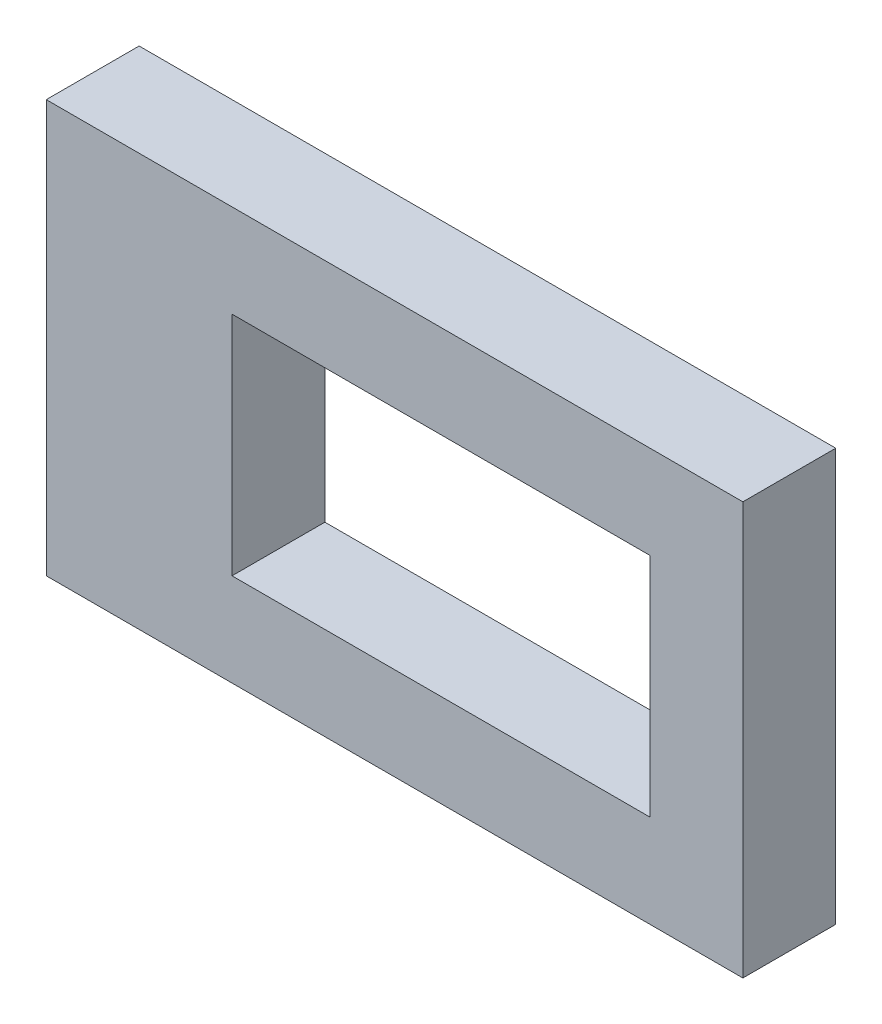
ISO-10303-21;
HEADER;
FILE_DESCRIPTION(('STEP AP214'),'2;1');
FILE_NAME('part.step','',(''),(''),'','','');
FILE_SCHEMA(('AUTOMOTIVE_DESIGN { 1 0 10303 214 1 1 1 1 }'));
ENDSEC;
DATA;
#1=APPLICATION_CONTEXT('core data for automotive mechanical design processes');
#2=APPLICATION_PROTOCOL_DEFINITION('international standard','automotive_design',2000,#1);
#3=PRODUCT_CONTEXT('',#1,'mechanical');
#4=PRODUCT('Part','Part','',(#3));
#5=PRODUCT_RELATED_PRODUCT_CATEGORY('part','',(#4));
#6=PRODUCT_DEFINITION_FORMATION('','',#4);
#7=PRODUCT_DEFINITION_CONTEXT('part definition',#1,'design');
#8=PRODUCT_DEFINITION('design','',#6,#7);
#9=PRODUCT_DEFINITION_SHAPE('','',#8);
#10=(LENGTH_UNIT() NAMED_UNIT(*) SI_UNIT(.MILLI.,.METRE.));
#11=(NAMED_UNIT(*) PLANE_ANGLE_UNIT() SI_UNIT($,.RADIAN.));
#12=(NAMED_UNIT(*) SI_UNIT($,.STERADIAN.) SOLID_ANGLE_UNIT());
#13=UNCERTAINTY_MEASURE_WITH_UNIT(LENGTH_MEASURE(1.E-05),#10,'distance_accuracy_value','');
#14=(GEOMETRIC_REPRESENTATION_CONTEXT(3) GLOBAL_UNCERTAINTY_ASSIGNED_CONTEXT((#13)) GLOBAL_UNIT_ASSIGNED_CONTEXT((#10,
#11,#12)) REPRESENTATION_CONTEXT('',''));
#15=CARTESIAN_POINT('',(0.,0.,0.));
#16=DIRECTION('',(0.,0.,1.));
#17=DIRECTION('',(1.,0.,0.));
#18=AXIS2_PLACEMENT_3D('',#15,#16,#17);
#19=CARTESIAN_POINT('',(0.,0.,5.));
#20=DIRECTION('',(0.,0.,1.));
#21=DIRECTION('',(1.,0.,0.));
#22=AXIS2_PLACEMENT_3D('',#19,#20,#21);
#23=PLANE('',#22);
#24=DIRECTION('',(0.,1.,0.));
#25=VECTOR('',#24,1.);
#26=CARTESIAN_POINT('',(5.,-5.,5.));
#27=LINE('',#26,#25);
#28=CARTESIAN_POINT('',(5.,-5.,5.));
#29=VERTEX_POINT('',#28);
#30=CARTESIAN_POINT('',(5.,17.2,5.));
#31=VERTEX_POINT('',#30);
#32=EDGE_CURVE('E153',#29,#31,#27,.T.);
#33=ORIENTED_EDGE('',*,*,#32,.T.);
#34=DIRECTION('',(-1.,0.,0.));
#35=VECTOR('',#34,1.);
#36=CARTESIAN_POINT('',(5.,17.2,5.));
#37=LINE('',#36,#35);
#38=CARTESIAN_POINT('',(-32.5,17.2,5.));
#39=VERTEX_POINT('',#38);
#40=EDGE_CURVE('E157',#31,#39,#37,.T.);
#41=ORIENTED_EDGE('',*,*,#40,.T.);
#42=DIRECTION('',(0.,-1.,0.));
#43=VECTOR('',#42,1.);
#44=CARTESIAN_POINT('',(-32.5,-5.,5.));
#45=LINE('',#44,#43);
#46=CARTESIAN_POINT('',(-32.5,-5.,5.));
#47=VERTEX_POINT('',#46);
#48=EDGE_CURVE('E161',#39,#47,#45,.T.);
#49=ORIENTED_EDGE('',*,*,#48,.T.);
#50=DIRECTION('',(1.,0.,0.));
#51=VECTOR('',#50,1.);
#52=CARTESIAN_POINT('',(5.,-5.,5.));
#53=LINE('',#52,#51);
#54=EDGE_CURVE('E164',#47,#29,#53,.T.);
#55=ORIENTED_EDGE('',*,*,#54,.T.);
#56=EDGE_LOOP('',(#33,#41,#49,#55));
#57=FACE_BOUND('',#56,.T.);
#58=DIRECTION('',(-1.,0.,0.));
#59=VECTOR('',#58,1.);
#60=CARTESIAN_POINT('',(0.,12.2,5.));
#61=LINE('',#60,#59);
#62=CARTESIAN_POINT('',(0.,12.2,5.));
#63=VERTEX_POINT('',#62);
#64=CARTESIAN_POINT('',(-22.5,12.2,5.));
#65=VERTEX_POINT('',#64);
#66=EDGE_CURVE('E114',#63,#65,#61,.T.);
#67=ORIENTED_EDGE('',*,*,#66,.F.);
#68=DIRECTION('',(0.,1.,0.));
#69=VECTOR('',#68,1.);
#70=CARTESIAN_POINT('',(0.,0.,5.));
#71=LINE('',#70,#69);
#72=CARTESIAN_POINT('',(0.,0.,5.));
#73=VERTEX_POINT('',#72);
#74=EDGE_CURVE('E105',#73,#63,#71,.T.);
#75=ORIENTED_EDGE('',*,*,#74,.F.);
#76=DIRECTION('',(1.,0.,0.));
#77=VECTOR('',#76,1.);
#78=CARTESIAN_POINT('',(0.,0.,5.));
#79=LINE('',#78,#77);
#80=CARTESIAN_POINT('',(-22.5,0.,5.));
#81=VERTEX_POINT('',#80);
#82=EDGE_CURVE('E131',#81,#73,#79,.T.);
#83=ORIENTED_EDGE('',*,*,#82,.F.);
#84=DIRECTION('',(0.,-1.,0.));
#85=VECTOR('',#84,1.);
#86=CARTESIAN_POINT('',(-22.5,0.,5.));
#87=LINE('',#86,#85);
#88=EDGE_CURVE('E127',#65,#81,#87,.T.);
#89=ORIENTED_EDGE('',*,*,#88,.F.);
#90=EDGE_LOOP('',(#67,#75,#83,#89));
#91=FACE_BOUND('',#90,.T.);
#92=ADVANCED_FACE('F39',(#57,#91),#23,.T.);
#93=CARTESIAN_POINT('',(0.,0.,0.));
#94=DIRECTION('',(0.,0.,1.));
#95=DIRECTION('',(1.,0.,0.));
#96=AXIS2_PLACEMENT_3D('',#93,#94,#95);
#97=PLANE('',#96);
#98=DIRECTION('',(0.,1.,0.));
#99=VECTOR('',#98,1.);
#100=CARTESIAN_POINT('',(5.,-5.,0.));
#101=LINE('',#100,#99);
#102=CARTESIAN_POINT('',(5.,-5.,0.));
#103=VERTEX_POINT('',#102);
#104=CARTESIAN_POINT('',(5.,17.2,0.));
#105=VERTEX_POINT('',#104);
#106=EDGE_CURVE('E123',#103,#105,#101,.T.);
#107=ORIENTED_EDGE('',*,*,#106,.F.);
#108=DIRECTION('',(1.,0.,0.));
#109=VECTOR('',#108,1.);
#110=CARTESIAN_POINT('',(5.,-5.,0.));
#111=LINE('',#110,#109);
#112=CARTESIAN_POINT('',(-32.5,-5.,0.));
#113=VERTEX_POINT('',#112);
#114=EDGE_CURVE('E158',#113,#103,#111,.T.);
#115=ORIENTED_EDGE('',*,*,#114,.F.);
#116=DIRECTION('',(0.,-1.,0.));
#117=VECTOR('',#116,1.);
#118=CARTESIAN_POINT('',(-32.5,-5.,0.));
#119=LINE('',#118,#117);
#120=CARTESIAN_POINT('',(-32.5,17.2,0.));
#121=VERTEX_POINT('',#120);
#122=EDGE_CURVE('E174',#121,#113,#119,.T.);
#123=ORIENTED_EDGE('',*,*,#122,.F.);
#124=DIRECTION('',(-1.,0.,0.));
#125=VECTOR('',#124,1.);
#126=CARTESIAN_POINT('',(5.,17.2,0.));
#127=LINE('',#126,#125);
#128=EDGE_CURVE('E171',#105,#121,#127,.T.);
#129=ORIENTED_EDGE('',*,*,#128,.F.);
#130=EDGE_LOOP('',(#107,#115,#123,#129));
#131=FACE_BOUND('',#130,.T.);
#132=DIRECTION('',(0.,1.,0.));
#133=VECTOR('',#132,1.);
#134=CARTESIAN_POINT('',(0.,0.,0.));
#135=LINE('',#134,#133);
#136=CARTESIAN_POINT('',(0.,0.,0.));
#137=VERTEX_POINT('',#136);
#138=CARTESIAN_POINT('',(0.,12.2,0.));
#139=VERTEX_POINT('',#138);
#140=EDGE_CURVE('E63',#137,#139,#135,.T.);
#141=ORIENTED_EDGE('',*,*,#140,.T.);
#142=DIRECTION('',(-1.,0.,0.));
#143=VECTOR('',#142,1.);
#144=CARTESIAN_POINT('',(0.,12.2,0.));
#145=LINE('',#144,#143);
#146=CARTESIAN_POINT('',(-22.5,12.2,0.));
#147=VERTEX_POINT('',#146);
#148=EDGE_CURVE('E121',#139,#147,#145,.T.);
#149=ORIENTED_EDGE('',*,*,#148,.T.);
#150=DIRECTION('',(0.,-1.,0.));
#151=VECTOR('',#150,1.);
#152=CARTESIAN_POINT('',(-22.5,0.,0.));
#153=LINE('',#152,#151);
#154=CARTESIAN_POINT('',(-22.5,0.,0.));
#155=VERTEX_POINT('',#154);
#156=EDGE_CURVE('E140',#147,#155,#153,.T.);
#157=ORIENTED_EDGE('',*,*,#156,.T.);
#158=DIRECTION('',(1.,0.,0.));
#159=VECTOR('',#158,1.);
#160=CARTESIAN_POINT('',(0.,0.,0.));
#161=LINE('',#160,#159);
#162=EDGE_CURVE('E115',#155,#137,#161,.T.);
#163=ORIENTED_EDGE('',*,*,#162,.T.);
#164=EDGE_LOOP('',(#141,#149,#157,#163));
#165=FACE_BOUND('',#164,.T.);
#166=ADVANCED_FACE('F197',(#131,#165),#97,.F.);
#167=CARTESIAN_POINT('',(5.,-5.,5.));
#168=DIRECTION('',(-1.,0.,0.));
#169=DIRECTION('',(0.,-1.,0.));
#170=AXIS2_PLACEMENT_3D('',#167,#168,#169);
#171=PLANE('',#170);
#172=ORIENTED_EDGE('',*,*,#106,.T.);
#173=DIRECTION('',(0.,0.,-1.));
#174=VECTOR('',#173,1.);
#175=CARTESIAN_POINT('',(5.,17.2,5.));
#176=LINE('',#175,#174);
#177=EDGE_CURVE('E11',#31,#105,#176,.T.);
#178=ORIENTED_EDGE('',*,*,#177,.F.);
#179=ORIENTED_EDGE('',*,*,#32,.F.);
#180=DIRECTION('',(0.,0.,-1.));
#181=VECTOR('',#180,1.);
#182=CARTESIAN_POINT('',(5.,-5.,5.));
#183=LINE('',#182,#181);
#184=EDGE_CURVE('E167',#29,#103,#183,.T.);
#185=ORIENTED_EDGE('',*,*,#184,.T.);
#186=EDGE_LOOP('',(#172,#178,#179,#185));
#187=FACE_BOUND('',#186,.T.);
#188=ADVANCED_FACE('F41',(#187),#171,.F.);
#189=CARTESIAN_POINT('',(5.,17.2,5.));
#190=DIRECTION('',(0.,-1.,0.));
#191=DIRECTION('',(1.,0.,0.));
#192=AXIS2_PLACEMENT_3D('',#189,#190,#191);
#193=PLANE('',#192);
#194=ORIENTED_EDGE('',*,*,#128,.T.);
#195=DIRECTION('',(0.,0.,-1.));
#196=VECTOR('',#195,1.);
#197=CARTESIAN_POINT('',(-32.5,17.2,5.));
#198=LINE('',#197,#196);
#199=EDGE_CURVE('E48',#39,#121,#198,.T.);
#200=ORIENTED_EDGE('',*,*,#199,.F.);
#201=ORIENTED_EDGE('',*,*,#40,.F.);
#202=ORIENTED_EDGE('',*,*,#177,.T.);
#203=EDGE_LOOP('',(#194,#200,#201,#202));
#204=FACE_BOUND('',#203,.T.);
#205=ADVANCED_FACE('F207',(#204),#193,.F.);
#206=CARTESIAN_POINT('',(-32.5,-5.,5.));
#207=DIRECTION('',(1.,0.,0.));
#208=DIRECTION('',(0.,0.,-1.));
#209=AXIS2_PLACEMENT_3D('',#206,#207,#208);
#210=PLANE('',#209);
#211=ORIENTED_EDGE('',*,*,#122,.T.);
#212=DIRECTION('',(0.,0.,-1.));
#213=VECTOR('',#212,1.);
#214=CARTESIAN_POINT('',(-32.5,-5.,5.));
#215=LINE('',#214,#213);
#216=EDGE_CURVE('E182',#47,#113,#215,.T.);
#217=ORIENTED_EDGE('',*,*,#216,.F.);
#218=ORIENTED_EDGE('',*,*,#48,.F.);
#219=ORIENTED_EDGE('',*,*,#199,.T.);
#220=EDGE_LOOP('',(#211,#217,#218,#219));
#221=FACE_BOUND('',#220,.T.);
#222=ADVANCED_FACE('F191',(#221),#210,.F.);
#223=CARTESIAN_POINT('',(5.,-5.,5.));
#224=DIRECTION('',(0.,1.,0.));
#225=DIRECTION('',(0.,0.,1.));
#226=AXIS2_PLACEMENT_3D('',#223,#224,#225);
#227=PLANE('',#226);
#228=ORIENTED_EDGE('',*,*,#114,.T.);
#229=ORIENTED_EDGE('',*,*,#184,.F.);
#230=ORIENTED_EDGE('',*,*,#54,.F.);
#231=ORIENTED_EDGE('',*,*,#216,.T.);
#232=EDGE_LOOP('',(#228,#229,#230,#231));
#233=FACE_BOUND('',#232,.T.);
#234=ADVANCED_FACE('F201',(#233),#227,.F.);
#235=CARTESIAN_POINT('',(0.,0.,5.));
#236=DIRECTION('',(-1.,0.,0.));
#237=DIRECTION('',(0.,-1.,0.));
#238=AXIS2_PLACEMENT_3D('',#235,#236,#237);
#239=PLANE('',#238);
#240=ORIENTED_EDGE('',*,*,#140,.F.);
#241=DIRECTION('',(0.,0.,-1.));
#242=VECTOR('',#241,1.);
#243=CARTESIAN_POINT('',(0.,0.,5.));
#244=LINE('',#243,#242);
#245=EDGE_CURVE('E109',#73,#137,#244,.T.);
#246=ORIENTED_EDGE('',*,*,#245,.F.);
#247=ORIENTED_EDGE('',*,*,#74,.T.);
#248=DIRECTION('',(0.,0.,-1.));
#249=VECTOR('',#248,1.);
#250=CARTESIAN_POINT('',(0.,12.2,5.));
#251=LINE('',#250,#249);
#252=EDGE_CURVE('E108',#63,#139,#251,.T.);
#253=ORIENTED_EDGE('',*,*,#252,.T.);
#254=EDGE_LOOP('',(#240,#246,#247,#253));
#255=FACE_BOUND('',#254,.T.);
#256=ADVANCED_FACE('F107',(#255),#239,.T.);
#257=CARTESIAN_POINT('',(0.,12.2,5.));
#258=DIRECTION('',(0.,-1.,0.));
#259=DIRECTION('',(0.,0.,-1.));
#260=AXIS2_PLACEMENT_3D('',#257,#258,#259);
#261=PLANE('',#260);
#262=ORIENTED_EDGE('',*,*,#148,.F.);
#263=ORIENTED_EDGE('',*,*,#252,.F.);
#264=ORIENTED_EDGE('',*,*,#66,.T.);
#265=DIRECTION('',(0.,0.,-1.));
#266=VECTOR('',#265,1.);
#267=CARTESIAN_POINT('',(-22.5,12.2,5.));
#268=LINE('',#267,#266);
#269=EDGE_CURVE('E124',#65,#147,#268,.T.);
#270=ORIENTED_EDGE('',*,*,#269,.T.);
#271=EDGE_LOOP('',(#262,#263,#264,#270));
#272=FACE_BOUND('',#271,.T.);
#273=ADVANCED_FACE('F118',(#272),#261,.T.);
#274=CARTESIAN_POINT('',(-22.5,0.,5.));
#275=DIRECTION('',(1.,0.,0.));
#276=DIRECTION('',(0.,0.,-1.));
#277=AXIS2_PLACEMENT_3D('',#274,#275,#276);
#278=PLANE('',#277);
#279=ORIENTED_EDGE('',*,*,#156,.F.);
#280=ORIENTED_EDGE('',*,*,#269,.F.);
#281=ORIENTED_EDGE('',*,*,#88,.T.);
#282=DIRECTION('',(0.,0.,-1.));
#283=VECTOR('',#282,1.);
#284=CARTESIAN_POINT('',(-22.5,0.,5.));
#285=LINE('',#284,#283);
#286=EDGE_CURVE('E55',#81,#155,#285,.T.);
#287=ORIENTED_EDGE('',*,*,#286,.T.);
#288=EDGE_LOOP('',(#279,#280,#281,#287));
#289=FACE_BOUND('',#288,.T.);
#290=ADVANCED_FACE('F230',(#289),#278,.T.);
#291=CARTESIAN_POINT('',(0.,0.,5.));
#292=DIRECTION('',(0.,1.,0.));
#293=DIRECTION('',(-1.,0.,0.));
#294=AXIS2_PLACEMENT_3D('',#291,#292,#293);
#295=PLANE('',#294);
#296=ORIENTED_EDGE('',*,*,#162,.F.);
#297=ORIENTED_EDGE('',*,*,#286,.F.);
#298=ORIENTED_EDGE('',*,*,#82,.T.);
#299=ORIENTED_EDGE('',*,*,#245,.T.);
#300=EDGE_LOOP('',(#296,#297,#298,#299));
#301=FACE_BOUND('',#300,.T.);
#302=ADVANCED_FACE('F234',(#301),#295,.T.);
#303=CLOSED_SHELL('',(#92,#166,#188,#205,#222,#234,#256,#273,#290,#302));
#304=MANIFOLD_SOLID_BREP('B2',#303);
#305=ADVANCED_BREP_SHAPE_REPRESENTATION('',(#18,#304),#14);
#306=SHAPE_DEFINITION_REPRESENTATION(#9,#305);
ENDSEC;
END-ISO-10303-21;
